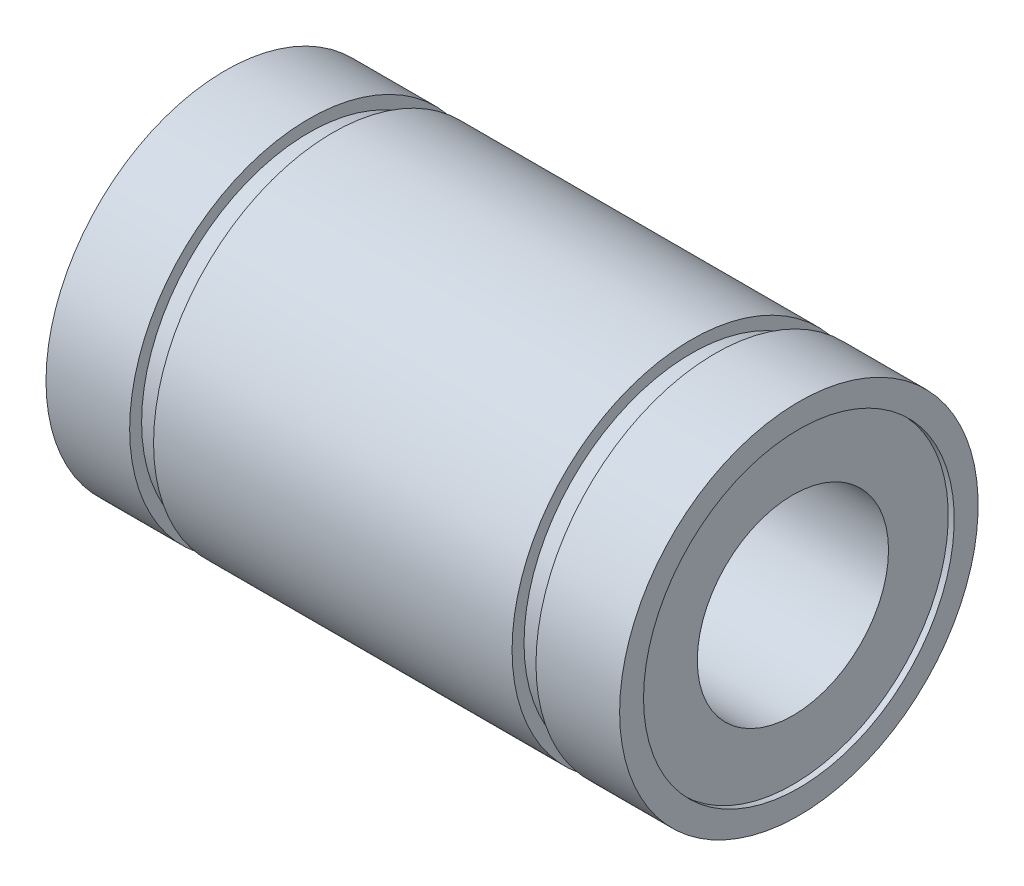
ISO-10303-21;
HEADER;
FILE_DESCRIPTION(('STEP AP214'),'2;1');
FILE_NAME('part.step','',(''),(''),'','','');
FILE_SCHEMA(('AUTOMOTIVE_DESIGN { 1 0 10303 214 1 1 1 1 }'));
ENDSEC;
DATA;
#1=APPLICATION_CONTEXT('core data for automotive mechanical design processes');
#2=APPLICATION_PROTOCOL_DEFINITION('international standard','automotive_design',2000,#1);
#3=PRODUCT_CONTEXT('',#1,'mechanical');
#4=PRODUCT('Part','Part','',(#3));
#5=PRODUCT_RELATED_PRODUCT_CATEGORY('part','',(#4));
#6=PRODUCT_DEFINITION_FORMATION('','',#4);
#7=PRODUCT_DEFINITION_CONTEXT('part definition',#1,'design');
#8=PRODUCT_DEFINITION('design','',#6,#7);
#9=PRODUCT_DEFINITION_SHAPE('','',#8);
#10=(LENGTH_UNIT() NAMED_UNIT(*) SI_UNIT(.MILLI.,.METRE.));
#11=(NAMED_UNIT(*) PLANE_ANGLE_UNIT() SI_UNIT($,.RADIAN.));
#12=(NAMED_UNIT(*) SI_UNIT($,.STERADIAN.) SOLID_ANGLE_UNIT());
#13=UNCERTAINTY_MEASURE_WITH_UNIT(LENGTH_MEASURE(1.E-05),#10,'distance_accuracy_value','');
#14=(GEOMETRIC_REPRESENTATION_CONTEXT(3) GLOBAL_UNCERTAINTY_ASSIGNED_CONTEXT((#13)) GLOBAL_UNIT_ASSIGNED_CONTEXT((#10,
#11,#12)) REPRESENTATION_CONTEXT('',''));
#15=CARTESIAN_POINT('',(0.,0.,0.));
#16=DIRECTION('',(0.,0.,1.));
#17=DIRECTION('',(1.,0.,0.));
#18=AXIS2_PLACEMENT_3D('',#15,#16,#17);
#19=CARTESIAN_POINT('',(-11.75,0.,-6.5));
#20=DIRECTION('',(1.,0.,0.));
#21=DIRECTION('',(0.,0.,-1.));
#22=AXIS2_PLACEMENT_3D('',#19,#20,#21);
#23=PLANE('',#22);
#24=CARTESIAN_POINT('',(-11.75,0.,0.));
#25=DIRECTION('',(-1.,0.,0.));
#26=DIRECTION('',(0.,0.,1.));
#27=AXIS2_PLACEMENT_3D('',#24,#25,#26);
#28=CIRCLE('',#27,4.);
#29=CARTESIAN_POINT('',(-11.75,0.,4.));
#30=VERTEX_POINT('',#29);
#31=EDGE_CURVE('E10',#30,#30,#28,.T.);
#32=ORIENTED_EDGE('',*,*,#31,.F.);
#33=EDGE_LOOP('',(#32));
#34=FACE_BOUND('',#33,.T.);
#35=CARTESIAN_POINT('',(-11.75,0.,0.));
#36=DIRECTION('',(-1.,0.,0.));
#37=DIRECTION('',(0.,0.,1.));
#38=AXIS2_PLACEMENT_3D('',#35,#36,#37);
#39=CIRCLE('',#38,6.5);
#40=CARTESIAN_POINT('',(-11.75,0.,6.5));
#41=VERTEX_POINT('',#40);
#42=EDGE_CURVE('E86',#41,#41,#39,.T.);
#43=ORIENTED_EDGE('',*,*,#42,.T.);
#44=EDGE_LOOP('',(#43));
#45=FACE_BOUND('',#44,.T.);
#46=ADVANCED_FACE('F34',(#34,#45),#23,.F.);
#47=CARTESIAN_POINT('',(-10.6666666666667,0.,0.));
#48=DIRECTION('',(-1.,0.,0.));
#49=DIRECTION('',(0.,0.,1.));
#50=AXIS2_PLACEMENT_3D('',#47,#48,#49);
#51=CYLINDRICAL_SURFACE('',#50,4.);
#52=CARTESIAN_POINT('',(11.75,0.,0.));
#53=DIRECTION('',(-1.,0.,0.));
#54=DIRECTION('',(0.,0.,1.));
#55=AXIS2_PLACEMENT_3D('',#52,#53,#54);
#56=CIRCLE('',#55,4.);
#57=CARTESIAN_POINT('',(11.75,0.,4.));
#58=VERTEX_POINT('',#57);
#59=EDGE_CURVE('E40',#58,#58,#56,.T.);
#60=ORIENTED_EDGE('',*,*,#59,.F.);
#61=EDGE_LOOP('',(#60));
#62=FACE_BOUND('',#61,.T.);
#63=ORIENTED_EDGE('',*,*,#31,.T.);
#64=EDGE_LOOP('',(#63));
#65=FACE_BOUND('',#64,.T.);
#66=ADVANCED_FACE('F171',(#62,#65),#51,.F.);
#67=CARTESIAN_POINT('',(11.75,0.,-4.));
#68=DIRECTION('',(-1.,0.,0.));
#69=DIRECTION('',(0.,0.,1.));
#70=AXIS2_PLACEMENT_3D('',#67,#68,#69);
#71=PLANE('',#70);
#72=CARTESIAN_POINT('',(11.75,0.,0.));
#73=DIRECTION('',(-1.,0.,0.));
#74=DIRECTION('',(0.,0.,1.));
#75=AXIS2_PLACEMENT_3D('',#72,#73,#74);
#76=CIRCLE('',#75,6.5);
#77=CARTESIAN_POINT('',(11.75,0.,6.5));
#78=VERTEX_POINT('',#77);
#79=EDGE_CURVE('E44',#78,#78,#76,.T.);
#80=ORIENTED_EDGE('',*,*,#79,.F.);
#81=EDGE_LOOP('',(#80));
#82=FACE_BOUND('',#81,.T.);
#83=ORIENTED_EDGE('',*,*,#59,.T.);
#84=EDGE_LOOP('',(#83));
#85=FACE_BOUND('',#84,.T.);
#86=ADVANCED_FACE('F166',(#82,#85),#71,.F.);
#87=CARTESIAN_POINT('',(-10.6666666666667,0.,0.));
#88=DIRECTION('',(-1.,0.,0.));
#89=DIRECTION('',(0.,0.,1.));
#90=AXIS2_PLACEMENT_3D('',#87,#88,#89);
#91=CYLINDRICAL_SURFACE('',#90,6.5);
#92=CARTESIAN_POINT('',(12.,0.,0.));
#93=DIRECTION('',(-1.,0.,0.));
#94=DIRECTION('',(0.,0.,1.));
#95=AXIS2_PLACEMENT_3D('',#92,#93,#94);
#96=CIRCLE('',#95,6.5);
#97=CARTESIAN_POINT('',(12.,0.,6.5));
#98=VERTEX_POINT('',#97);
#99=EDGE_CURVE('E48',#98,#98,#96,.T.);
#100=ORIENTED_EDGE('',*,*,#99,.F.);
#101=EDGE_LOOP('',(#100));
#102=FACE_BOUND('',#101,.T.);
#103=ORIENTED_EDGE('',*,*,#79,.T.);
#104=EDGE_LOOP('',(#103));
#105=FACE_BOUND('',#104,.T.);
#106=ADVANCED_FACE('F160',(#102,#105),#91,.F.);
#107=CARTESIAN_POINT('',(12.,0.,-6.5));
#108=DIRECTION('',(-1.,0.,0.));
#109=DIRECTION('',(0.,0.,1.));
#110=AXIS2_PLACEMENT_3D('',#107,#108,#109);
#111=PLANE('',#110);
#112=CARTESIAN_POINT('',(12.,0.,0.));
#113=DIRECTION('',(-1.,0.,0.));
#114=DIRECTION('',(0.,0.,1.));
#115=AXIS2_PLACEMENT_3D('',#112,#113,#114);
#116=CIRCLE('',#115,7.5);
#117=CARTESIAN_POINT('',(12.,0.,7.5));
#118=VERTEX_POINT('',#117);
#119=EDGE_CURVE('E53',#118,#118,#116,.T.);
#120=ORIENTED_EDGE('',*,*,#119,.F.);
#121=EDGE_LOOP('',(#120));
#122=FACE_BOUND('',#121,.T.);
#123=ORIENTED_EDGE('',*,*,#99,.T.);
#124=EDGE_LOOP('',(#123));
#125=FACE_BOUND('',#124,.T.);
#126=ADVANCED_FACE('F154',(#122,#125),#111,.F.);
#127=CARTESIAN_POINT('',(-10.6666666666667,0.,0.));
#128=DIRECTION('',(-1.,0.,0.));
#129=DIRECTION('',(0.,0.,1.));
#130=AXIS2_PLACEMENT_3D('',#127,#128,#129);
#131=CYLINDRICAL_SURFACE('',#130,7.5);
#132=CARTESIAN_POINT('',(8.5,0.,0.));
#133=DIRECTION('',(-1.,0.,0.));
#134=DIRECTION('',(0.,0.,1.));
#135=AXIS2_PLACEMENT_3D('',#132,#133,#134);
#136=CIRCLE('',#135,7.5);
#137=CARTESIAN_POINT('',(8.5,0.,7.5));
#138=VERTEX_POINT('',#137);
#139=EDGE_CURVE('E56',#138,#138,#136,.T.);
#140=ORIENTED_EDGE('',*,*,#139,.F.);
#141=EDGE_LOOP('',(#140));
#142=FACE_BOUND('',#141,.T.);
#143=ORIENTED_EDGE('',*,*,#119,.T.);
#144=EDGE_LOOP('',(#143));
#145=FACE_BOUND('',#144,.T.);
#146=ADVANCED_FACE('F148',(#142,#145),#131,.T.);
#147=CARTESIAN_POINT('',(8.5,0.,-7.5));
#148=DIRECTION('',(1.,0.,0.));
#149=DIRECTION('',(0.,0.,-1.));
#150=AXIS2_PLACEMENT_3D('',#147,#148,#149);
#151=PLANE('',#150);
#152=CARTESIAN_POINT('',(8.5,0.,0.));
#153=DIRECTION('',(-1.,0.,0.));
#154=DIRECTION('',(0.,0.,1.));
#155=AXIS2_PLACEMENT_3D('',#152,#153,#154);
#156=CIRCLE('',#155,7.);
#157=CARTESIAN_POINT('',(8.5,0.,7.));
#158=VERTEX_POINT('',#157);
#159=EDGE_CURVE('E59',#158,#158,#156,.T.);
#160=ORIENTED_EDGE('',*,*,#159,.F.);
#161=EDGE_LOOP('',(#160));
#162=FACE_BOUND('',#161,.T.);
#163=ORIENTED_EDGE('',*,*,#139,.T.);
#164=EDGE_LOOP('',(#163));
#165=FACE_BOUND('',#164,.T.);
#166=ADVANCED_FACE('F142',(#162,#165),#151,.F.);
#167=CARTESIAN_POINT('',(-10.6666666666667,0.,0.));
#168=DIRECTION('',(-1.,0.,0.));
#169=DIRECTION('',(0.,0.,1.));
#170=AXIS2_PLACEMENT_3D('',#167,#168,#169);
#171=CYLINDRICAL_SURFACE('',#170,7.);
#172=CARTESIAN_POINT('',(7.5,0.,0.));
#173=DIRECTION('',(-1.,0.,0.));
#174=DIRECTION('',(0.,0.,1.));
#175=AXIS2_PLACEMENT_3D('',#172,#173,#174);
#176=CIRCLE('',#175,7.);
#177=CARTESIAN_POINT('',(7.5,0.,7.));
#178=VERTEX_POINT('',#177);
#179=EDGE_CURVE('E62',#178,#178,#176,.T.);
#180=ORIENTED_EDGE('',*,*,#179,.F.);
#181=EDGE_LOOP('',(#180));
#182=FACE_BOUND('',#181,.T.);
#183=ORIENTED_EDGE('',*,*,#159,.T.);
#184=EDGE_LOOP('',(#183));
#185=FACE_BOUND('',#184,.T.);
#186=ADVANCED_FACE('F136',(#182,#185),#171,.T.);
#187=CARTESIAN_POINT('',(7.5,0.,-7.));
#188=DIRECTION('',(-1.,0.,0.));
#189=DIRECTION('',(0.,0.,1.));
#190=AXIS2_PLACEMENT_3D('',#187,#188,#189);
#191=PLANE('',#190);
#192=CARTESIAN_POINT('',(7.5,0.,0.));
#193=DIRECTION('',(-1.,0.,0.));
#194=DIRECTION('',(0.,0.,1.));
#195=AXIS2_PLACEMENT_3D('',#192,#193,#194);
#196=CIRCLE('',#195,7.5);
#197=CARTESIAN_POINT('',(7.5,0.,7.5));
#198=VERTEX_POINT('',#197);
#199=EDGE_CURVE('E65',#198,#198,#196,.T.);
#200=ORIENTED_EDGE('',*,*,#199,.F.);
#201=EDGE_LOOP('',(#200));
#202=FACE_BOUND('',#201,.T.);
#203=ORIENTED_EDGE('',*,*,#179,.T.);
#204=EDGE_LOOP('',(#203));
#205=FACE_BOUND('',#204,.T.);
#206=ADVANCED_FACE('F130',(#202,#205),#191,.F.);
#207=CARTESIAN_POINT('',(-10.6666666666667,0.,0.));
#208=DIRECTION('',(-1.,0.,0.));
#209=DIRECTION('',(0.,0.,1.));
#210=AXIS2_PLACEMENT_3D('',#207,#208,#209);
#211=CYLINDRICAL_SURFACE('',#210,7.5);
#212=CARTESIAN_POINT('',(-7.5,0.,0.));
#213=DIRECTION('',(-1.,0.,0.));
#214=DIRECTION('',(0.,0.,1.));
#215=AXIS2_PLACEMENT_3D('',#212,#213,#214);
#216=CIRCLE('',#215,7.5);
#217=CARTESIAN_POINT('',(-7.5,0.,7.5));
#218=VERTEX_POINT('',#217);
#219=EDGE_CURVE('E68',#218,#218,#216,.T.);
#220=ORIENTED_EDGE('',*,*,#219,.F.);
#221=EDGE_LOOP('',(#220));
#222=FACE_BOUND('',#221,.T.);
#223=ORIENTED_EDGE('',*,*,#199,.T.);
#224=EDGE_LOOP('',(#223));
#225=FACE_BOUND('',#224,.T.);
#226=ADVANCED_FACE('F124',(#222,#225),#211,.T.);
#227=CARTESIAN_POINT('',(-7.5,0.,-7.5));
#228=DIRECTION('',(1.,0.,0.));
#229=DIRECTION('',(0.,0.,-1.));
#230=AXIS2_PLACEMENT_3D('',#227,#228,#229);
#231=PLANE('',#230);
#232=CARTESIAN_POINT('',(-7.5,0.,0.));
#233=DIRECTION('',(-1.,0.,0.));
#234=DIRECTION('',(0.,0.,1.));
#235=AXIS2_PLACEMENT_3D('',#232,#233,#234);
#236=CIRCLE('',#235,7.);
#237=CARTESIAN_POINT('',(-7.5,0.,7.));
#238=VERTEX_POINT('',#237);
#239=EDGE_CURVE('E71',#238,#238,#236,.T.);
#240=ORIENTED_EDGE('',*,*,#239,.F.);
#241=EDGE_LOOP('',(#240));
#242=FACE_BOUND('',#241,.T.);
#243=ORIENTED_EDGE('',*,*,#219,.T.);
#244=EDGE_LOOP('',(#243));
#245=FACE_BOUND('',#244,.T.);
#246=ADVANCED_FACE('F118',(#242,#245),#231,.F.);
#247=CARTESIAN_POINT('',(-10.6666666666667,0.,0.));
#248=DIRECTION('',(-1.,0.,0.));
#249=DIRECTION('',(0.,0.,1.));
#250=AXIS2_PLACEMENT_3D('',#247,#248,#249);
#251=CYLINDRICAL_SURFACE('',#250,7.);
#252=CARTESIAN_POINT('',(-8.5,0.,0.));
#253=DIRECTION('',(-1.,0.,0.));
#254=DIRECTION('',(0.,0.,1.));
#255=AXIS2_PLACEMENT_3D('',#252,#253,#254);
#256=CIRCLE('',#255,7.);
#257=CARTESIAN_POINT('',(-8.5,0.,7.));
#258=VERTEX_POINT('',#257);
#259=EDGE_CURVE('E74',#258,#258,#256,.T.);
#260=ORIENTED_EDGE('',*,*,#259,.F.);
#261=EDGE_LOOP('',(#260));
#262=FACE_BOUND('',#261,.T.);
#263=ORIENTED_EDGE('',*,*,#239,.T.);
#264=EDGE_LOOP('',(#263));
#265=FACE_BOUND('',#264,.T.);
#266=ADVANCED_FACE('F112',(#262,#265),#251,.T.);
#267=CARTESIAN_POINT('',(-8.5,0.,-7.));
#268=DIRECTION('',(-1.,0.,0.));
#269=DIRECTION('',(0.,0.,1.));
#270=AXIS2_PLACEMENT_3D('',#267,#268,#269);
#271=PLANE('',#270);
#272=CARTESIAN_POINT('',(-8.5,0.,0.));
#273=DIRECTION('',(-1.,0.,0.));
#274=DIRECTION('',(0.,0.,1.));
#275=AXIS2_PLACEMENT_3D('',#272,#273,#274);
#276=CIRCLE('',#275,7.5);
#277=CARTESIAN_POINT('',(-8.5,0.,7.5));
#278=VERTEX_POINT('',#277);
#279=EDGE_CURVE('E77',#278,#278,#276,.T.);
#280=ORIENTED_EDGE('',*,*,#279,.F.);
#281=EDGE_LOOP('',(#280));
#282=FACE_BOUND('',#281,.T.);
#283=ORIENTED_EDGE('',*,*,#259,.T.);
#284=EDGE_LOOP('',(#283));
#285=FACE_BOUND('',#284,.T.);
#286=ADVANCED_FACE('F106',(#282,#285),#271,.F.);
#287=CARTESIAN_POINT('',(-10.6666666666667,0.,0.));
#288=DIRECTION('',(-1.,0.,0.));
#289=DIRECTION('',(0.,0.,1.));
#290=AXIS2_PLACEMENT_3D('',#287,#288,#289);
#291=CYLINDRICAL_SURFACE('',#290,7.5);
#292=CARTESIAN_POINT('',(-12.,0.,0.));
#293=DIRECTION('',(-1.,0.,0.));
#294=DIRECTION('',(0.,0.,1.));
#295=AXIS2_PLACEMENT_3D('',#292,#293,#294);
#296=CIRCLE('',#295,7.5);
#297=CARTESIAN_POINT('',(-12.,0.,7.5));
#298=VERTEX_POINT('',#297);
#299=EDGE_CURVE('E80',#298,#298,#296,.T.);
#300=ORIENTED_EDGE('',*,*,#299,.F.);
#301=EDGE_LOOP('',(#300));
#302=FACE_BOUND('',#301,.T.);
#303=ORIENTED_EDGE('',*,*,#279,.T.);
#304=EDGE_LOOP('',(#303));
#305=FACE_BOUND('',#304,.T.);
#306=ADVANCED_FACE('F100',(#302,#305),#291,.T.);
#307=CARTESIAN_POINT('',(-12.,0.,-7.5));
#308=DIRECTION('',(1.,0.,0.));
#309=DIRECTION('',(0.,0.,-1.));
#310=AXIS2_PLACEMENT_3D('',#307,#308,#309);
#311=PLANE('',#310);
#312=CARTESIAN_POINT('',(-12.,0.,0.));
#313=DIRECTION('',(-1.,0.,0.));
#314=DIRECTION('',(0.,0.,1.));
#315=AXIS2_PLACEMENT_3D('',#312,#313,#314);
#316=CIRCLE('',#315,6.5);
#317=CARTESIAN_POINT('',(-12.,0.,6.5));
#318=VERTEX_POINT('',#317);
#319=EDGE_CURVE('E83',#318,#318,#316,.T.);
#320=ORIENTED_EDGE('',*,*,#319,.F.);
#321=EDGE_LOOP('',(#320));
#322=FACE_BOUND('',#321,.T.);
#323=ORIENTED_EDGE('',*,*,#299,.T.);
#324=EDGE_LOOP('',(#323));
#325=FACE_BOUND('',#324,.T.);
#326=ADVANCED_FACE('F94',(#322,#325),#311,.F.);
#327=CARTESIAN_POINT('',(-10.6666666666667,0.,0.));
#328=DIRECTION('',(-1.,0.,0.));
#329=DIRECTION('',(0.,0.,1.));
#330=AXIS2_PLACEMENT_3D('',#327,#328,#329);
#331=CYLINDRICAL_SURFACE('',#330,6.5);
#332=ORIENTED_EDGE('',*,*,#42,.F.);
#333=EDGE_LOOP('',(#332));
#334=FACE_BOUND('',#333,.T.);
#335=ORIENTED_EDGE('',*,*,#319,.T.);
#336=EDGE_LOOP('',(#335));
#337=FACE_BOUND('',#336,.T.);
#338=ADVANCED_FACE('F91',(#334,#337),#331,.F.);
#339=CLOSED_SHELL('',(#46,#66,#86,#106,#126,#146,#166,#186,#206,#226,#246,#266,#286,#306,#326,#338));
#340=MANIFOLD_SOLID_BREP('B2',#339);
#341=ADVANCED_BREP_SHAPE_REPRESENTATION('',(#18,#340),#14);
#342=SHAPE_DEFINITION_REPRESENTATION(#9,#341);
ENDSEC;
END-ISO-10303-21;
